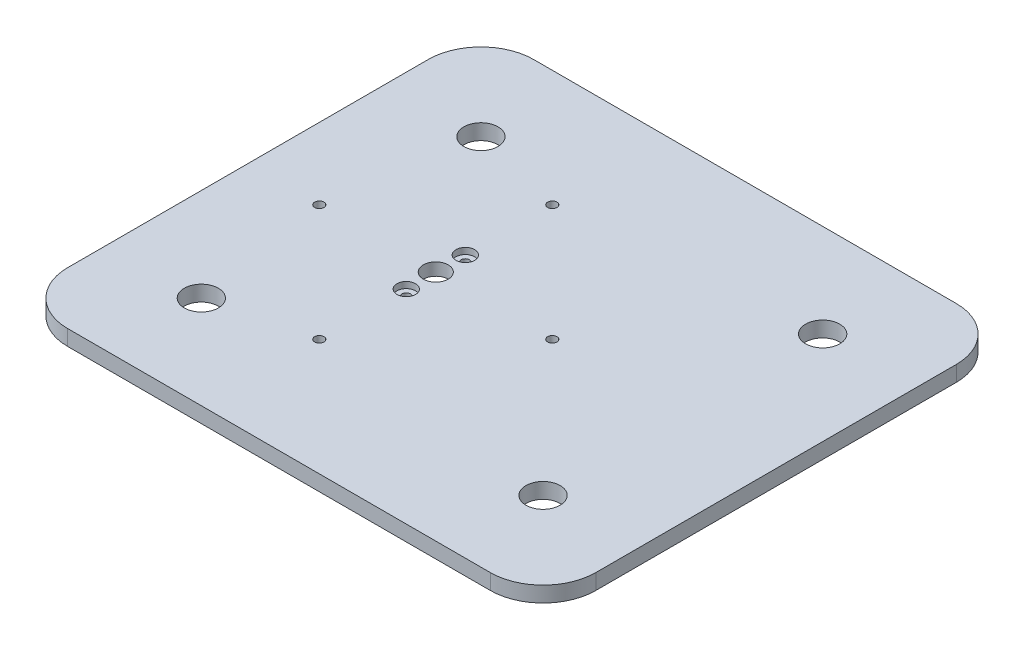
ISO-10303-21;
HEADER;
FILE_DESCRIPTION(('STEP AP214'),'2;1');
FILE_NAME('part.step','',(''),(''),'','','');
FILE_SCHEMA(('AUTOMOTIVE_DESIGN { 1 0 10303 214 1 1 1 1 }'));
ENDSEC;
DATA;
#1=APPLICATION_CONTEXT('core data for automotive mechanical design processes');
#2=APPLICATION_PROTOCOL_DEFINITION('international standard','automotive_design',2000,#1);
#3=PRODUCT_CONTEXT('',#1,'mechanical');
#4=PRODUCT('Part','Part','',(#3));
#5=PRODUCT_RELATED_PRODUCT_CATEGORY('part','',(#4));
#6=PRODUCT_DEFINITION_FORMATION('','',#4);
#7=PRODUCT_DEFINITION_CONTEXT('part definition',#1,'design');
#8=PRODUCT_DEFINITION('design','',#6,#7);
#9=PRODUCT_DEFINITION_SHAPE('','',#8);
#10=(LENGTH_UNIT() NAMED_UNIT(*) SI_UNIT(.MILLI.,.METRE.));
#11=(NAMED_UNIT(*) PLANE_ANGLE_UNIT() SI_UNIT($,.RADIAN.));
#12=(NAMED_UNIT(*) SI_UNIT($,.STERADIAN.) SOLID_ANGLE_UNIT());
#13=UNCERTAINTY_MEASURE_WITH_UNIT(LENGTH_MEASURE(1.E-05),#10,'distance_accuracy_value','');
#14=(GEOMETRIC_REPRESENTATION_CONTEXT(3) GLOBAL_UNCERTAINTY_ASSIGNED_CONTEXT((#13)) GLOBAL_UNIT_ASSIGNED_CONTEXT((#10,
#11,#12)) REPRESENTATION_CONTEXT('',''));
#15=CARTESIAN_POINT('',(0.,0.,0.));
#16=DIRECTION('',(0.,0.,1.));
#17=DIRECTION('',(1.,0.,0.));
#18=AXIS2_PLACEMENT_3D('',#15,#16,#17);
#19=CARTESIAN_POINT('',(236.203309246,-315.2128970931,-9.5));
#20=DIRECTION('',(0.,1.,0.));
#21=DIRECTION('',(0.,0.,1.));
#22=AXIS2_PLACEMENT_3D('',#19,#20,#21);
#23=CYLINDRICAL_SURFACE('',#22,1.34999999999998);
#24=CARTESIAN_POINT('',(236.203309246,-307.2128970931,-9.5));
#25=DIRECTION('',(0.,1.,0.));
#26=DIRECTION('',(0.,0.,1.));
#27=AXIS2_PLACEMENT_3D('',#24,#25,#26);
#28=CIRCLE('',#27,1.34999999999998);
#29=CARTESIAN_POINT('',(236.203309246,-307.2128970931,-8.15000000000002));
#30=VERTEX_POINT('',#29);
#31=EDGE_CURVE('E214',#30,#30,#28,.F.);
#32=ORIENTED_EDGE('',*,*,#31,.F.);
#33=EDGE_LOOP('',(#32));
#34=FACE_BOUND('',#33,.T.);
#35=CARTESIAN_POINT('',(236.203309246,-309.2128970931,-9.5));
#36=DIRECTION('',(0.,1.,0.));
#37=DIRECTION('',(0.,0.,1.));
#38=AXIS2_PLACEMENT_3D('',#35,#36,#37);
#39=CIRCLE('',#38,1.34999999999998);
#40=CARTESIAN_POINT('',(236.203309246,-309.2128970931,-8.15000000000002));
#41=VERTEX_POINT('',#40);
#42=EDGE_CURVE('E212',#41,#41,#39,.T.);
#43=ORIENTED_EDGE('',*,*,#42,.F.);
#44=EDGE_LOOP('',(#43));
#45=FACE_BOUND('',#44,.T.);
#46=ADVANCED_FACE('F17',(#34,#45),#23,.F.);
#47=CARTESIAN_POINT('',(236.203309246,-315.2128970931,9.5));
#48=DIRECTION('',(0.,1.,0.));
#49=DIRECTION('',(0.,0.,1.));
#50=AXIS2_PLACEMENT_3D('',#47,#48,#49);
#51=CYLINDRICAL_SURFACE('',#50,1.34999999999998);
#52=CARTESIAN_POINT('',(236.203309246,-307.2128970931,9.5));
#53=DIRECTION('',(0.,1.,0.));
#54=DIRECTION('',(0.,0.,1.));
#55=AXIS2_PLACEMENT_3D('',#52,#53,#54);
#56=CIRCLE('',#55,1.34999999999998);
#57=CARTESIAN_POINT('',(236.203309246,-307.2128970931,10.85));
#58=VERTEX_POINT('',#57);
#59=EDGE_CURVE('E20',#58,#58,#56,.F.);
#60=ORIENTED_EDGE('',*,*,#59,.F.);
#61=EDGE_LOOP('',(#60));
#62=FACE_BOUND('',#61,.T.);
#63=CARTESIAN_POINT('',(236.203309246,-309.2128970931,9.5));
#64=DIRECTION('',(0.,1.,0.));
#65=DIRECTION('',(0.,0.,1.));
#66=AXIS2_PLACEMENT_3D('',#63,#64,#65);
#67=CIRCLE('',#66,1.34999999999998);
#68=CARTESIAN_POINT('',(236.203309246,-309.2128970931,10.85));
#69=VERTEX_POINT('',#68);
#70=EDGE_CURVE('E206',#69,#69,#67,.T.);
#71=ORIENTED_EDGE('',*,*,#70,.F.);
#72=EDGE_LOOP('',(#71));
#73=FACE_BOUND('',#72,.T.);
#74=ADVANCED_FACE('F224',(#62,#73),#51,.F.);
#75=CARTESIAN_POINT('',(236.203309246,-309.2128970931,0.));
#76=DIRECTION('',(0.,-1.,0.));
#77=DIRECTION('',(0.,0.,-1.));
#78=AXIS2_PLACEMENT_3D('',#75,#76,#77);
#79=CYLINDRICAL_SURFACE('',#78,42.5);
#80=CARTESIAN_POINT('',(236.203309246,-309.2128970931,0.));
#81=DIRECTION('',(0.,-1.,0.));
#82=DIRECTION('',(0.,0.,-1.));
#83=AXIS2_PLACEMENT_3D('',#80,#81,#82);
#84=CIRCLE('',#83,42.5);
#85=CARTESIAN_POINT('',(236.203309246,-309.2128970931,-42.5));
#86=VERTEX_POINT('',#85);
#87=EDGE_CURVE('E209',#86,#86,#84,.T.);
#88=ORIENTED_EDGE('',*,*,#87,.F.);
#89=EDGE_LOOP('',(#88));
#90=FACE_BOUND('',#89,.T.);
#91=CARTESIAN_POINT('',(236.203309246,-310.2128970931,0.));
#92=DIRECTION('',(0.,-1.,0.));
#93=DIRECTION('',(0.,0.,-1.));
#94=AXIS2_PLACEMENT_3D('',#91,#92,#93);
#95=CIRCLE('',#94,42.5);
#96=CARTESIAN_POINT('',(236.203309246,-310.2128970931,-42.5));
#97=VERTEX_POINT('',#96);
#98=EDGE_CURVE('E203',#97,#97,#95,.T.);
#99=ORIENTED_EDGE('',*,*,#98,.T.);
#100=EDGE_LOOP('',(#99));
#101=FACE_BOUND('',#100,.T.);
#102=ADVANCED_FACE('F227',(#90,#101),#79,.F.);
#103=CARTESIAN_POINT('',(236.203309246,-307.2128970931,9.5));
#104=DIRECTION('',(0.,1.,0.));
#105=DIRECTION('',(0.,0.,1.));
#106=AXIS2_PLACEMENT_3D('',#103,#104,#105);
#107=PLANE('',#106);
#108=ORIENTED_EDGE('',*,*,#59,.T.);
#109=EDGE_LOOP('',(#108));
#110=FACE_BOUND('',#109,.T.);
#111=CARTESIAN_POINT('',(236.203309246,-307.2128970931,9.5));
#112=DIRECTION('',(0.,1.,0.));
#113=DIRECTION('',(0.,0.,1.));
#114=AXIS2_PLACEMENT_3D('',#111,#112,#113);
#115=CIRCLE('',#114,2.99999999999999);
#116=CARTESIAN_POINT('',(236.203309246,-307.2128970931,12.5));
#117=VERTEX_POINT('',#116);
#118=EDGE_CURVE('E188',#117,#117,#115,.T.);
#119=ORIENTED_EDGE('',*,*,#118,.T.);
#120=EDGE_LOOP('',(#119));
#121=FACE_BOUND('',#120,.T.);
#122=ADVANCED_FACE('F221',(#110,#121),#107,.T.);
#123=CARTESIAN_POINT('',(236.203309246,-307.2128970931,-9.5));
#124=DIRECTION('',(0.,1.,0.));
#125=DIRECTION('',(0.,0.,1.));
#126=AXIS2_PLACEMENT_3D('',#123,#124,#125);
#127=PLANE('',#126);
#128=ORIENTED_EDGE('',*,*,#31,.T.);
#129=EDGE_LOOP('',(#128));
#130=FACE_BOUND('',#129,.T.);
#131=CARTESIAN_POINT('',(236.203309246,-307.2128970931,-9.5));
#132=DIRECTION('',(0.,1.,0.));
#133=DIRECTION('',(0.,0.,1.));
#134=AXIS2_PLACEMENT_3D('',#131,#132,#133);
#135=CIRCLE('',#134,2.99999999999999);
#136=CARTESIAN_POINT('',(236.203309246,-307.2128970931,-6.50000000000001));
#137=VERTEX_POINT('',#136);
#138=EDGE_CURVE('E185',#137,#137,#135,.T.);
#139=ORIENTED_EDGE('',*,*,#138,.T.);
#140=EDGE_LOOP('',(#139));
#141=FACE_BOUND('',#140,.T.);
#142=ADVANCED_FACE('F233',(#130,#141),#127,.T.);
#143=CARTESIAN_POINT('',(236.203309246,-309.2128970931,0.));
#144=DIRECTION('',(0.,-1.,0.));
#145=DIRECTION('',(0.,0.,-1.));
#146=AXIS2_PLACEMENT_3D('',#143,#144,#145);
#147=PLANE('',#146);
#148=ORIENTED_EDGE('',*,*,#70,.T.);
#149=EDGE_LOOP('',(#148));
#150=FACE_BOUND('',#149,.T.);
#151=CARTESIAN_POINT('',(236.203309246,-309.2128970931,0.));
#152=DIRECTION('',(0.,-1.,0.));
#153=DIRECTION('',(0.,0.,-1.));
#154=AXIS2_PLACEMENT_3D('',#151,#152,#153);
#155=CIRCLE('',#154,3.99999999999999);
#156=CARTESIAN_POINT('',(236.203309246,-309.2128970931,-3.99999999999999));
#157=VERTEX_POINT('',#156);
#158=EDGE_CURVE('E103',#157,#157,#155,.F.);
#159=ORIENTED_EDGE('',*,*,#158,.T.);
#160=EDGE_LOOP('',(#159));
#161=FACE_BOUND('',#160,.T.);
#162=CARTESIAN_POINT('',(236.203309246,-309.2128970931,-37.5));
#163=DIRECTION('',(0.,1.,0.));
#164=DIRECTION('',(0.,0.,1.));
#165=AXIS2_PLACEMENT_3D('',#162,#163,#164);
#166=CIRCLE('',#165,1.49999999999999);
#167=CARTESIAN_POINT('',(236.203309246,-309.2128970931,-36.));
#168=VERTEX_POINT('',#167);
#169=EDGE_CURVE('E176',#168,#168,#166,.T.);
#170=ORIENTED_EDGE('',*,*,#169,.T.);
#171=EDGE_LOOP('',(#170));
#172=FACE_BOUND('',#171,.T.);
#173=CARTESIAN_POINT('',(236.203309246,-309.2128970931,37.5));
#174=DIRECTION('',(0.,1.,0.));
#175=DIRECTION('',(0.,0.,1.));
#176=AXIS2_PLACEMENT_3D('',#173,#174,#175);
#177=CIRCLE('',#176,1.49999999999999);
#178=CARTESIAN_POINT('',(236.203309246,-309.2128970931,39.));
#179=VERTEX_POINT('',#178);
#180=EDGE_CURVE('E182',#179,#179,#177,.T.);
#181=ORIENTED_EDGE('',*,*,#180,.T.);
#182=EDGE_LOOP('',(#181));
#183=FACE_BOUND('',#182,.T.);
#184=ORIENTED_EDGE('',*,*,#87,.T.);
#185=EDGE_LOOP('',(#184));
#186=FACE_BOUND('',#185,.T.);
#187=CARTESIAN_POINT('',(273.703309246,-309.2128970931,0.));
#188=DIRECTION('',(0.,1.,0.));
#189=DIRECTION('',(0.,0.,1.));
#190=AXIS2_PLACEMENT_3D('',#187,#188,#189);
#191=CIRCLE('',#190,1.50000000000002);
#192=CARTESIAN_POINT('',(273.703309246,-309.2128970931,1.50000000000002));
#193=VERTEX_POINT('',#192);
#194=EDGE_CURVE('E179',#193,#193,#191,.T.);
#195=ORIENTED_EDGE('',*,*,#194,.T.);
#196=EDGE_LOOP('',(#195));
#197=FACE_BOUND('',#196,.T.);
#198=CARTESIAN_POINT('',(198.703309246,-309.2128970931,0.));
#199=DIRECTION('',(0.,1.,0.));
#200=DIRECTION('',(0.,0.,1.));
#201=AXIS2_PLACEMENT_3D('',#198,#199,#200);
#202=CIRCLE('',#201,1.5);
#203=CARTESIAN_POINT('',(198.703309246,-309.2128970931,1.5));
#204=VERTEX_POINT('',#203);
#205=EDGE_CURVE('E173',#204,#204,#202,.T.);
#206=ORIENTED_EDGE('',*,*,#205,.T.);
#207=EDGE_LOOP('',(#206));
#208=FACE_BOUND('',#207,.T.);
#209=ORIENTED_EDGE('',*,*,#42,.T.);
#210=EDGE_LOOP('',(#209));
#211=FACE_BOUND('',#210,.T.);
#212=ADVANCED_FACE('F230',(#150,#161,#172,#183,#186,#197,#208,#211),#147,.T.);
#213=CARTESIAN_POINT('',(345.7354284339,-310.2128970931,0.));
#214=DIRECTION('',(0.,1.,0.));
#215=DIRECTION('',(0.,0.,1.));
#216=AXIS2_PLACEMENT_3D('',#213,#214,#215);
#217=PLANE('',#216);
#218=CARTESIAN_POINT('',(192.7354284339,-310.2128970931,-58.));
#219=DIRECTION('',(0.,1.,0.));
#220=DIRECTION('',(0.,0.,1.));
#221=AXIS2_PLACEMENT_3D('',#218,#219,#220);
#222=CIRCLE('',#221,17.);
#223=CARTESIAN_POINT('',(192.7354284339,-310.2128970931,-75.));
#224=VERTEX_POINT('',#223);
#225=CARTESIAN_POINT('',(175.7354284339,-310.2128970931,-58.));
#226=VERTEX_POINT('',#225);
#227=EDGE_CURVE('E169',#224,#226,#222,.T.);
#228=ORIENTED_EDGE('',*,*,#227,.F.);
#229=DIRECTION('',(1.,0.,0.));
#230=VECTOR('',#229,1.);
#231=CARTESIAN_POINT('',(0.,-310.2128970931,-75.));
#232=LINE('',#231,#230);
#233=CARTESIAN_POINT('',(328.7354284339,-310.2128970931,-75.));
#234=VERTEX_POINT('',#233);
#235=EDGE_CURVE('E117',#224,#234,#232,.T.);
#236=ORIENTED_EDGE('',*,*,#235,.T.);
#237=CARTESIAN_POINT('',(328.7354284339,-310.2128970931,-58.));
#238=DIRECTION('',(0.,-1.,0.));
#239=DIRECTION('',(0.,0.,-1.));
#240=AXIS2_PLACEMENT_3D('',#237,#238,#239);
#241=CIRCLE('',#240,17.);
#242=CARTESIAN_POINT('',(345.7354284339,-310.2128970931,-58.));
#243=VERTEX_POINT('',#242);
#244=EDGE_CURVE('E167',#243,#234,#241,.F.);
#245=ORIENTED_EDGE('',*,*,#244,.F.);
#246=DIRECTION('',(0.,0.,-1.));
#247=VECTOR('',#246,1.);
#248=CARTESIAN_POINT('',(345.7354284339,-310.2128970931,0.));
#249=LINE('',#248,#247);
#250=CARTESIAN_POINT('',(345.7354284339,-310.2128970931,58.));
#251=VERTEX_POINT('',#250);
#252=EDGE_CURVE('E113',#251,#243,#249,.T.);
#253=ORIENTED_EDGE('',*,*,#252,.F.);
#254=CARTESIAN_POINT('',(328.7354284339,-310.2128970931,58.));
#255=DIRECTION('',(0.,1.,0.));
#256=DIRECTION('',(0.,0.,1.));
#257=AXIS2_PLACEMENT_3D('',#254,#255,#256);
#258=CIRCLE('',#257,17.);
#259=CARTESIAN_POINT('',(328.7354284339,-310.2128970931,75.));
#260=VERTEX_POINT('',#259);
#261=EDGE_CURVE('E99',#260,#251,#258,.T.);
#262=ORIENTED_EDGE('',*,*,#261,.F.);
#263=DIRECTION('',(1.,0.,0.));
#264=VECTOR('',#263,1.);
#265=CARTESIAN_POINT('',(0.,-310.2128970931,75.));
#266=LINE('',#265,#264);
#267=CARTESIAN_POINT('',(192.7354284339,-310.2128970931,75.));
#268=VERTEX_POINT('',#267);
#269=EDGE_CURVE('E92',#268,#260,#266,.T.);
#270=ORIENTED_EDGE('',*,*,#269,.F.);
#271=CARTESIAN_POINT('',(192.7354284339,-310.2128970931,58.));
#272=DIRECTION('',(0.,-1.,0.));
#273=DIRECTION('',(0.,0.,-1.));
#274=AXIS2_PLACEMENT_3D('',#271,#272,#273);
#275=CIRCLE('',#274,17.);
#276=CARTESIAN_POINT('',(175.7354284339,-310.2128970931,58.));
#277=VERTEX_POINT('',#276);
#278=EDGE_CURVE('E83',#277,#268,#275,.F.);
#279=ORIENTED_EDGE('',*,*,#278,.F.);
#280=DIRECTION('',(0.,0.,1.));
#281=VECTOR('',#280,1.);
#282=CARTESIAN_POINT('',(175.7354284339,-310.2128970931,0.));
#283=LINE('',#282,#281);
#284=EDGE_CURVE('E78',#226,#277,#283,.T.);
#285=ORIENTED_EDGE('',*,*,#284,.F.);
#286=EDGE_LOOP('',(#228,#236,#245,#253,#262,#270,#279,#285));
#287=FACE_BOUND('',#286,.T.);
#288=ORIENTED_EDGE('',*,*,#98,.F.);
#289=EDGE_LOOP('',(#288));
#290=FACE_BOUND('',#289,.T.);
#291=CARTESIAN_POINT('',(205.7354284339,-310.2128970931,-45.));
#292=DIRECTION('',(0.,-1.,0.));
#293=DIRECTION('',(0.,0.,-1.));
#294=AXIS2_PLACEMENT_3D('',#291,#292,#293);
#295=CIRCLE('',#294,5.50000000000002);
#296=CARTESIAN_POINT('',(205.7354284339,-310.2128970931,-50.5));
#297=VERTEX_POINT('',#296);
#298=EDGE_CURVE('E191',#297,#297,#295,.F.);
#299=ORIENTED_EDGE('',*,*,#298,.T.);
#300=EDGE_LOOP('',(#299));
#301=FACE_BOUND('',#300,.T.);
#302=CARTESIAN_POINT('',(205.7354284339,-310.2128970931,45.));
#303=DIRECTION('',(0.,-1.,0.));
#304=DIRECTION('',(0.,0.,-1.));
#305=AXIS2_PLACEMENT_3D('',#302,#303,#304);
#306=CIRCLE('',#305,5.50000000000002);
#307=CARTESIAN_POINT('',(205.7354284339,-310.2128970931,39.5));
#308=VERTEX_POINT('',#307);
#309=EDGE_CURVE('E194',#308,#308,#306,.F.);
#310=ORIENTED_EDGE('',*,*,#309,.T.);
#311=EDGE_LOOP('',(#310));
#312=FACE_BOUND('',#311,.T.);
#313=CARTESIAN_POINT('',(315.7354284339,-310.2128970931,-45.));
#314=DIRECTION('',(0.,-1.,0.));
#315=DIRECTION('',(0.,0.,-1.));
#316=AXIS2_PLACEMENT_3D('',#313,#314,#315);
#317=CIRCLE('',#316,5.50000000000002);
#318=CARTESIAN_POINT('',(315.7354284339,-310.2128970931,-50.5));
#319=VERTEX_POINT('',#318);
#320=EDGE_CURVE('E197',#319,#319,#317,.F.);
#321=ORIENTED_EDGE('',*,*,#320,.T.);
#322=EDGE_LOOP('',(#321));
#323=FACE_BOUND('',#322,.T.);
#324=CARTESIAN_POINT('',(315.7354284339,-310.2128970931,45.));
#325=DIRECTION('',(0.,-1.,0.));
#326=DIRECTION('',(0.,0.,-1.));
#327=AXIS2_PLACEMENT_3D('',#324,#325,#326);
#328=CIRCLE('',#327,5.50000000000002);
#329=CARTESIAN_POINT('',(315.7354284339,-310.2128970931,39.5));
#330=VERTEX_POINT('',#329);
#331=EDGE_CURVE('E200',#330,#330,#328,.F.);
#332=ORIENTED_EDGE('',*,*,#331,.T.);
#333=EDGE_LOOP('',(#332));
#334=FACE_BOUND('',#333,.T.);
#335=ADVANCED_FACE('F96',(#287,#290,#301,#312,#323,#334),#217,.F.);
#336=CARTESIAN_POINT('',(315.7354284339,-300.2128970931,45.));
#337=DIRECTION('',(0.,-1.,0.));
#338=DIRECTION('',(0.,0.,-1.));
#339=AXIS2_PLACEMENT_3D('',#336,#337,#338);
#340=CYLINDRICAL_SURFACE('',#339,5.50000000000002);
#341=CARTESIAN_POINT('',(315.7354284339,-305.2128970931,45.));
#342=DIRECTION('',(0.,-1.,0.));
#343=DIRECTION('',(0.,0.,-1.));
#344=AXIS2_PLACEMENT_3D('',#341,#342,#343);
#345=CIRCLE('',#344,5.50000000000002);
#346=CARTESIAN_POINT('',(315.7354284339,-305.2128970931,39.5));
#347=VERTEX_POINT('',#346);
#348=EDGE_CURVE('E162',#347,#347,#345,.F.);
#349=ORIENTED_EDGE('',*,*,#348,.T.);
#350=EDGE_LOOP('',(#349));
#351=FACE_BOUND('',#350,.T.);
#352=ORIENTED_EDGE('',*,*,#331,.F.);
#353=EDGE_LOOP('',(#352));
#354=FACE_BOUND('',#353,.T.);
#355=ADVANCED_FACE('F328',(#351,#354),#340,.F.);
#356=CARTESIAN_POINT('',(315.7354284339,-300.2128970931,-45.));
#357=DIRECTION('',(0.,-1.,0.));
#358=DIRECTION('',(0.,0.,-1.));
#359=AXIS2_PLACEMENT_3D('',#356,#357,#358);
#360=CYLINDRICAL_SURFACE('',#359,5.50000000000002);
#361=CARTESIAN_POINT('',(315.7354284339,-305.2128970931,-45.));
#362=DIRECTION('',(0.,-1.,0.));
#363=DIRECTION('',(0.,0.,-1.));
#364=AXIS2_PLACEMENT_3D('',#361,#362,#363);
#365=CIRCLE('',#364,5.50000000000002);
#366=CARTESIAN_POINT('',(315.7354284339,-305.2128970931,-50.5));
#367=VERTEX_POINT('',#366);
#368=EDGE_CURVE('E159',#367,#367,#365,.F.);
#369=ORIENTED_EDGE('',*,*,#368,.T.);
#370=EDGE_LOOP('',(#369));
#371=FACE_BOUND('',#370,.T.);
#372=ORIENTED_EDGE('',*,*,#320,.F.);
#373=EDGE_LOOP('',(#372));
#374=FACE_BOUND('',#373,.T.);
#375=ADVANCED_FACE('F324',(#371,#374),#360,.F.);
#376=CARTESIAN_POINT('',(205.7354284339,-300.2128970931,45.));
#377=DIRECTION('',(0.,-1.,0.));
#378=DIRECTION('',(0.,0.,-1.));
#379=AXIS2_PLACEMENT_3D('',#376,#377,#378);
#380=CYLINDRICAL_SURFACE('',#379,5.50000000000002);
#381=CARTESIAN_POINT('',(205.7354284339,-305.2128970931,45.));
#382=DIRECTION('',(0.,-1.,0.));
#383=DIRECTION('',(0.,0.,-1.));
#384=AXIS2_PLACEMENT_3D('',#381,#382,#383);
#385=CIRCLE('',#384,5.50000000000002);
#386=CARTESIAN_POINT('',(205.7354284339,-305.2128970931,39.5));
#387=VERTEX_POINT('',#386);
#388=EDGE_CURVE('E156',#387,#387,#385,.F.);
#389=ORIENTED_EDGE('',*,*,#388,.T.);
#390=EDGE_LOOP('',(#389));
#391=FACE_BOUND('',#390,.T.);
#392=ORIENTED_EDGE('',*,*,#309,.F.);
#393=EDGE_LOOP('',(#392));
#394=FACE_BOUND('',#393,.T.);
#395=ADVANCED_FACE('F320',(#391,#394),#380,.F.);
#396=CARTESIAN_POINT('',(205.7354284339,-300.2128970931,-45.));
#397=DIRECTION('',(0.,-1.,0.));
#398=DIRECTION('',(0.,0.,-1.));
#399=AXIS2_PLACEMENT_3D('',#396,#397,#398);
#400=CYLINDRICAL_SURFACE('',#399,5.50000000000002);
#401=CARTESIAN_POINT('',(205.7354284339,-305.2128970931,-45.));
#402=DIRECTION('',(0.,-1.,0.));
#403=DIRECTION('',(0.,0.,-1.));
#404=AXIS2_PLACEMENT_3D('',#401,#402,#403);
#405=CIRCLE('',#404,5.50000000000002);
#406=CARTESIAN_POINT('',(205.7354284339,-305.2128970931,-50.5));
#407=VERTEX_POINT('',#406);
#408=EDGE_CURVE('E153',#407,#407,#405,.F.);
#409=ORIENTED_EDGE('',*,*,#408,.T.);
#410=EDGE_LOOP('',(#409));
#411=FACE_BOUND('',#410,.T.);
#412=ORIENTED_EDGE('',*,*,#298,.F.);
#413=EDGE_LOOP('',(#412));
#414=FACE_BOUND('',#413,.T.);
#415=ADVANCED_FACE('F316',(#411,#414),#400,.F.);
#416=CARTESIAN_POINT('',(236.203309246,-307.2128970931,9.5));
#417=DIRECTION('',(0.,1.,0.));
#418=DIRECTION('',(0.,0.,1.));
#419=AXIS2_PLACEMENT_3D('',#416,#417,#418);
#420=CYLINDRICAL_SURFACE('',#419,2.99999999999999);
#421=ORIENTED_EDGE('',*,*,#118,.F.);
#422=EDGE_LOOP('',(#421));
#423=FACE_BOUND('',#422,.T.);
#424=CARTESIAN_POINT('',(236.203309246,-305.2128970931,9.5));
#425=DIRECTION('',(0.,1.,0.));
#426=DIRECTION('',(0.,0.,1.));
#427=AXIS2_PLACEMENT_3D('',#424,#425,#426);
#428=CIRCLE('',#427,2.99999999999999);
#429=CARTESIAN_POINT('',(236.203309246,-305.2128970931,12.5));
#430=VERTEX_POINT('',#429);
#431=EDGE_CURVE('E150',#430,#430,#428,.T.);
#432=ORIENTED_EDGE('',*,*,#431,.T.);
#433=EDGE_LOOP('',(#432));
#434=FACE_BOUND('',#433,.T.);
#435=ADVANCED_FACE('F312',(#423,#434),#420,.F.);
#436=CARTESIAN_POINT('',(236.203309246,-307.2128970931,-9.5));
#437=DIRECTION('',(0.,1.,0.));
#438=DIRECTION('',(0.,0.,1.));
#439=AXIS2_PLACEMENT_3D('',#436,#437,#438);
#440=CYLINDRICAL_SURFACE('',#439,2.99999999999999);
#441=ORIENTED_EDGE('',*,*,#138,.F.);
#442=EDGE_LOOP('',(#441));
#443=FACE_BOUND('',#442,.T.);
#444=CARTESIAN_POINT('',(236.203309246,-305.2128970931,-9.5));
#445=DIRECTION('',(0.,1.,0.));
#446=DIRECTION('',(0.,0.,1.));
#447=AXIS2_PLACEMENT_3D('',#444,#445,#446);
#448=CIRCLE('',#447,2.99999999999999);
#449=CARTESIAN_POINT('',(236.203309246,-305.2128970931,-6.50000000000001));
#450=VERTEX_POINT('',#449);
#451=EDGE_CURVE('E147',#450,#450,#448,.T.);
#452=ORIENTED_EDGE('',*,*,#451,.T.);
#453=EDGE_LOOP('',(#452));
#454=FACE_BOUND('',#453,.T.);
#455=ADVANCED_FACE('F308',(#443,#454),#440,.F.);
#456=CARTESIAN_POINT('',(236.203309246,-315.2128970931,37.5));
#457=DIRECTION('',(0.,1.,0.));
#458=DIRECTION('',(0.,0.,1.));
#459=AXIS2_PLACEMENT_3D('',#456,#457,#458);
#460=CYLINDRICAL_SURFACE('',#459,1.49999999999999);
#461=ORIENTED_EDGE('',*,*,#180,.F.);
#462=EDGE_LOOP('',(#461));
#463=FACE_BOUND('',#462,.T.);
#464=CARTESIAN_POINT('',(236.203309246,-305.2128970931,37.5));
#465=DIRECTION('',(0.,1.,0.));
#466=DIRECTION('',(0.,0.,1.));
#467=AXIS2_PLACEMENT_3D('',#464,#465,#466);
#468=CIRCLE('',#467,1.49999999999999);
#469=CARTESIAN_POINT('',(236.203309246,-305.2128970931,39.));
#470=VERTEX_POINT('',#469);
#471=EDGE_CURVE('E144',#470,#470,#468,.T.);
#472=ORIENTED_EDGE('',*,*,#471,.T.);
#473=EDGE_LOOP('',(#472));
#474=FACE_BOUND('',#473,.T.);
#475=ADVANCED_FACE('F304',(#463,#474),#460,.F.);
#476=CARTESIAN_POINT('',(273.703309246,-315.2128970931,0.));
#477=DIRECTION('',(0.,1.,0.));
#478=DIRECTION('',(0.,0.,1.));
#479=AXIS2_PLACEMENT_3D('',#476,#477,#478);
#480=CYLINDRICAL_SURFACE('',#479,1.50000000000002);
#481=ORIENTED_EDGE('',*,*,#194,.F.);
#482=EDGE_LOOP('',(#481));
#483=FACE_BOUND('',#482,.T.);
#484=CARTESIAN_POINT('',(273.703309246,-305.2128970931,0.));
#485=DIRECTION('',(0.,1.,0.));
#486=DIRECTION('',(0.,0.,1.));
#487=AXIS2_PLACEMENT_3D('',#484,#485,#486);
#488=CIRCLE('',#487,1.50000000000002);
#489=CARTESIAN_POINT('',(273.703309246,-305.2128970931,1.50000000000002));
#490=VERTEX_POINT('',#489);
#491=EDGE_CURVE('E141',#490,#490,#488,.T.);
#492=ORIENTED_EDGE('',*,*,#491,.T.);
#493=EDGE_LOOP('',(#492));
#494=FACE_BOUND('',#493,.T.);
#495=ADVANCED_FACE('F300',(#483,#494),#480,.F.);
#496=CARTESIAN_POINT('',(236.203309246,-315.2128970931,-37.5));
#497=DIRECTION('',(0.,1.,0.));
#498=DIRECTION('',(0.,0.,1.));
#499=AXIS2_PLACEMENT_3D('',#496,#497,#498);
#500=CYLINDRICAL_SURFACE('',#499,1.49999999999999);
#501=ORIENTED_EDGE('',*,*,#169,.F.);
#502=EDGE_LOOP('',(#501));
#503=FACE_BOUND('',#502,.T.);
#504=CARTESIAN_POINT('',(236.203309246,-305.2128970931,-37.5));
#505=DIRECTION('',(0.,1.,0.));
#506=DIRECTION('',(0.,0.,1.));
#507=AXIS2_PLACEMENT_3D('',#504,#505,#506);
#508=CIRCLE('',#507,1.49999999999999);
#509=CARTESIAN_POINT('',(236.203309246,-305.2128970931,-36.));
#510=VERTEX_POINT('',#509);
#511=EDGE_CURVE('E138',#510,#510,#508,.T.);
#512=ORIENTED_EDGE('',*,*,#511,.T.);
#513=EDGE_LOOP('',(#512));
#514=FACE_BOUND('',#513,.T.);
#515=ADVANCED_FACE('F296',(#503,#514),#500,.F.);
#516=CARTESIAN_POINT('',(198.703309246,-315.2128970931,0.));
#517=DIRECTION('',(0.,1.,0.));
#518=DIRECTION('',(0.,0.,1.));
#519=AXIS2_PLACEMENT_3D('',#516,#517,#518);
#520=CYLINDRICAL_SURFACE('',#519,1.5);
#521=ORIENTED_EDGE('',*,*,#205,.F.);
#522=EDGE_LOOP('',(#521));
#523=FACE_BOUND('',#522,.T.);
#524=CARTESIAN_POINT('',(198.703309246,-305.2128970931,0.));
#525=DIRECTION('',(0.,1.,0.));
#526=DIRECTION('',(0.,0.,1.));
#527=AXIS2_PLACEMENT_3D('',#524,#525,#526);
#528=CIRCLE('',#527,1.5);
#529=CARTESIAN_POINT('',(198.703309246,-305.2128970931,1.5));
#530=VERTEX_POINT('',#529);
#531=EDGE_CURVE('E135',#530,#530,#528,.T.);
#532=ORIENTED_EDGE('',*,*,#531,.T.);
#533=EDGE_LOOP('',(#532));
#534=FACE_BOUND('',#533,.T.);
#535=ADVANCED_FACE('F292',(#523,#534),#520,.F.);
#536=CARTESIAN_POINT('',(236.203309246,-300.2128970931,0.));
#537=DIRECTION('',(0.,-1.,0.));
#538=DIRECTION('',(0.,0.,-1.));
#539=AXIS2_PLACEMENT_3D('',#536,#537,#538);
#540=CYLINDRICAL_SURFACE('',#539,3.99999999999999);
#541=CARTESIAN_POINT('',(236.203309246,-305.2128970931,0.));
#542=DIRECTION('',(0.,-1.,0.));
#543=DIRECTION('',(0.,0.,-1.));
#544=AXIS2_PLACEMENT_3D('',#541,#542,#543);
#545=CIRCLE('',#544,3.99999999999999);
#546=CARTESIAN_POINT('',(236.203309246,-305.2128970931,-3.99999999999999));
#547=VERTEX_POINT('',#546);
#548=EDGE_CURVE('E132',#547,#547,#545,.F.);
#549=ORIENTED_EDGE('',*,*,#548,.T.);
#550=EDGE_LOOP('',(#549));
#551=FACE_BOUND('',#550,.T.);
#552=ORIENTED_EDGE('',*,*,#158,.F.);
#553=EDGE_LOOP('',(#552));
#554=FACE_BOUND('',#553,.T.);
#555=ADVANCED_FACE('F289',(#551,#554),#540,.F.);
#556=CARTESIAN_POINT('',(0.,0.,75.));
#557=DIRECTION('',(0.,0.,1.));
#558=DIRECTION('',(1.,0.,0.));
#559=AXIS2_PLACEMENT_3D('',#556,#557,#558);
#560=PLANE('',#559);
#561=ORIENTED_EDGE('',*,*,#269,.T.);
#562=DIRECTION('',(0.,1.,0.));
#563=VECTOR('',#562,1.);
#564=CARTESIAN_POINT('',(328.7354284339,-739.945452979,75.));
#565=LINE('',#564,#563);
#566=CARTESIAN_POINT('',(328.7354284339,-305.2128970931,75.));
#567=VERTEX_POINT('',#566);
#568=EDGE_CURVE('E166',#567,#260,#565,.F.);
#569=ORIENTED_EDGE('',*,*,#568,.F.);
#570=DIRECTION('',(1.,0.,0.));
#571=VECTOR('',#570,1.);
#572=CARTESIAN_POINT('',(175.7354284339,-305.2128970931,75.));
#573=LINE('',#572,#571);
#574=CARTESIAN_POINT('',(192.7354284339,-305.2128970931,75.));
#575=VERTEX_POINT('',#574);
#576=EDGE_CURVE('E107',#567,#575,#573,.F.);
#577=ORIENTED_EDGE('',*,*,#576,.T.);
#578=DIRECTION('',(0.,-1.,0.));
#579=VECTOR('',#578,1.);
#580=CARTESIAN_POINT('',(192.7354284339,418.7328062612,75.));
#581=LINE('',#580,#579);
#582=EDGE_CURVE('E88',#268,#575,#581,.F.);
#583=ORIENTED_EDGE('',*,*,#582,.F.);
#584=EDGE_LOOP('',(#561,#569,#577,#583));
#585=FACE_BOUND('',#584,.T.);
#586=ADVANCED_FACE('F106',(#585),#560,.T.);
#587=CARTESIAN_POINT('',(192.7354284339,418.7328062612,58.));
#588=DIRECTION('',(0.,-1.,0.));
#589=DIRECTION('',(0.,0.,-1.));
#590=AXIS2_PLACEMENT_3D('',#587,#588,#589);
#591=CYLINDRICAL_SURFACE('',#590,17.);
#592=ORIENTED_EDGE('',*,*,#278,.T.);
#593=ORIENTED_EDGE('',*,*,#582,.T.);
#594=CARTESIAN_POINT('',(192.7354284339,-305.2128970931,58.));
#595=DIRECTION('',(0.,-1.,0.));
#596=DIRECTION('',(0.,0.,-1.));
#597=AXIS2_PLACEMENT_3D('',#594,#595,#596);
#598=CIRCLE('',#597,17.);
#599=CARTESIAN_POINT('',(175.7354284339,-305.2128970931,58.));
#600=VERTEX_POINT('',#599);
#601=EDGE_CURVE('E130',#575,#600,#598,.T.);
#602=ORIENTED_EDGE('',*,*,#601,.T.);
#603=DIRECTION('',(0.,1.,0.));
#604=VECTOR('',#603,1.);
#605=CARTESIAN_POINT('',(175.7354284339,-304.2128970931,58.));
#606=LINE('',#605,#604);
#607=EDGE_CURVE('E90',#277,#600,#606,.T.);
#608=ORIENTED_EDGE('',*,*,#607,.F.);
#609=EDGE_LOOP('',(#592,#593,#602,#608));
#610=FACE_BOUND('',#609,.T.);
#611=ADVANCED_FACE('F85',(#610),#591,.T.);
#612=CARTESIAN_POINT('',(175.7354284339,-304.2128970931,0.));
#613=DIRECTION('',(-1.,0.,0.));
#614=DIRECTION('',(0.,0.,1.));
#615=AXIS2_PLACEMENT_3D('',#612,#613,#614);
#616=PLANE('',#615);
#617=ORIENTED_EDGE('',*,*,#284,.T.);
#618=ORIENTED_EDGE('',*,*,#607,.T.);
#619=DIRECTION('',(0.,0.,-1.));
#620=VECTOR('',#619,1.);
#621=CARTESIAN_POINT('',(175.7354284339,-305.2128970931,-75.));
#622=LINE('',#621,#620);
#623=CARTESIAN_POINT('',(175.7354284339,-305.2128970931,-58.));
#624=VERTEX_POINT('',#623);
#625=EDGE_CURVE('E129',#600,#624,#622,.T.);
#626=ORIENTED_EDGE('',*,*,#625,.T.);
#627=DIRECTION('',(0.,1.,0.));
#628=VECTOR('',#627,1.);
#629=CARTESIAN_POINT('',(175.7354284339,418.7328062612,-58.));
#630=LINE('',#629,#628);
#631=EDGE_CURVE('E120',#226,#624,#630,.T.);
#632=ORIENTED_EDGE('',*,*,#631,.F.);
#633=EDGE_LOOP('',(#617,#618,#626,#632));
#634=FACE_BOUND('',#633,.T.);
#635=ADVANCED_FACE('F281',(#634),#616,.T.);
#636=CARTESIAN_POINT('',(192.7354284339,418.7328062612,-58.));
#637=DIRECTION('',(0.,1.,0.));
#638=DIRECTION('',(0.,0.,1.));
#639=AXIS2_PLACEMENT_3D('',#636,#637,#638);
#640=CYLINDRICAL_SURFACE('',#639,17.);
#641=ORIENTED_EDGE('',*,*,#227,.T.);
#642=ORIENTED_EDGE('',*,*,#631,.T.);
#643=CARTESIAN_POINT('',(192.7354284339,-305.2128970931,-58.));
#644=DIRECTION('',(0.,1.,0.));
#645=DIRECTION('',(0.,0.,1.));
#646=AXIS2_PLACEMENT_3D('',#643,#644,#645);
#647=CIRCLE('',#646,17.);
#648=CARTESIAN_POINT('',(192.7354284339,-305.2128970931,-75.));
#649=VERTEX_POINT('',#648);
#650=EDGE_CURVE('E126',#624,#649,#647,.F.);
#651=ORIENTED_EDGE('',*,*,#650,.T.);
#652=DIRECTION('',(0.,1.,0.));
#653=VECTOR('',#652,1.);
#654=CARTESIAN_POINT('',(192.7354284339,0.,-75.));
#655=LINE('',#654,#653);
#656=EDGE_CURVE('E119',#649,#224,#655,.F.);
#657=ORIENTED_EDGE('',*,*,#656,.T.);
#658=EDGE_LOOP('',(#641,#642,#651,#657));
#659=FACE_BOUND('',#658,.T.);
#660=ADVANCED_FACE('F277',(#659),#640,.T.);
#661=CARTESIAN_POINT('',(0.,0.,-75.));
#662=DIRECTION('',(0.,0.,1.));
#663=DIRECTION('',(1.,0.,0.));
#664=AXIS2_PLACEMENT_3D('',#661,#662,#663);
#665=PLANE('',#664);
#666=DIRECTION('',(1.,0.,0.));
#667=VECTOR('',#666,1.);
#668=CARTESIAN_POINT('',(175.7354284339,-305.2128970931,-75.));
#669=LINE('',#668,#667);
#670=CARTESIAN_POINT('',(328.7354284339,-305.2128970931,-75.));
#671=VERTEX_POINT('',#670);
#672=EDGE_CURVE('E125',#649,#671,#669,.T.);
#673=ORIENTED_EDGE('',*,*,#672,.T.);
#674=DIRECTION('',(0.,-1.,0.));
#675=VECTOR('',#674,1.);
#676=CARTESIAN_POINT('',(328.7354284339,-739.945452979,-75.));
#677=LINE('',#676,#675);
#678=EDGE_CURVE('E115',#234,#671,#677,.F.);
#679=ORIENTED_EDGE('',*,*,#678,.F.);
#680=ORIENTED_EDGE('',*,*,#235,.F.);
#681=ORIENTED_EDGE('',*,*,#656,.F.);
#682=EDGE_LOOP('',(#673,#679,#680,#681));
#683=FACE_BOUND('',#682,.T.);
#684=ADVANCED_FACE('F273',(#683),#665,.F.);
#685=CARTESIAN_POINT('',(328.7354284339,-739.945452979,-58.));
#686=DIRECTION('',(0.,-1.,0.));
#687=DIRECTION('',(0.,0.,-1.));
#688=AXIS2_PLACEMENT_3D('',#685,#686,#687);
#689=CYLINDRICAL_SURFACE('',#688,17.);
#690=ORIENTED_EDGE('',*,*,#244,.T.);
#691=ORIENTED_EDGE('',*,*,#678,.T.);
#692=CARTESIAN_POINT('',(328.7354284339,-305.2128970931,-58.));
#693=DIRECTION('',(0.,-1.,0.));
#694=DIRECTION('',(0.,0.,-1.));
#695=AXIS2_PLACEMENT_3D('',#692,#693,#694);
#696=CIRCLE('',#695,17.);
#697=CARTESIAN_POINT('',(345.7354284339,-305.2128970931,-58.));
#698=VERTEX_POINT('',#697);
#699=EDGE_CURVE('E122',#671,#698,#696,.T.);
#700=ORIENTED_EDGE('',*,*,#699,.T.);
#701=DIRECTION('',(0.,1.,0.));
#702=VECTOR('',#701,1.);
#703=CARTESIAN_POINT('',(345.7354284339,-316.2128970931,-58.));
#704=LINE('',#703,#702);
#705=EDGE_CURVE('E114',#243,#698,#704,.T.);
#706=ORIENTED_EDGE('',*,*,#705,.F.);
#707=EDGE_LOOP('',(#690,#691,#700,#706));
#708=FACE_BOUND('',#707,.T.);
#709=ADVANCED_FACE('F269',(#708),#689,.T.);
#710=CARTESIAN_POINT('',(345.7354284339,-316.2128970931,0.));
#711=DIRECTION('',(1.,0.,0.));
#712=DIRECTION('',(0.,0.,-1.));
#713=AXIS2_PLACEMENT_3D('',#710,#711,#712);
#714=PLANE('',#713);
#715=ORIENTED_EDGE('',*,*,#252,.T.);
#716=ORIENTED_EDGE('',*,*,#705,.T.);
#717=DIRECTION('',(0.,0.,-1.));
#718=VECTOR('',#717,1.);
#719=CARTESIAN_POINT('',(345.7354284339,-305.2128970931,-75.));
#720=LINE('',#719,#718);
#721=CARTESIAN_POINT('',(345.7354284339,-305.2128970931,58.));
#722=VERTEX_POINT('',#721);
#723=EDGE_CURVE('E26',#698,#722,#720,.F.);
#724=ORIENTED_EDGE('',*,*,#723,.T.);
#725=DIRECTION('',(0.,1.,0.));
#726=VECTOR('',#725,1.);
#727=CARTESIAN_POINT('',(345.7354284339,-739.945452979,58.));
#728=LINE('',#727,#726);
#729=EDGE_CURVE('E34',#251,#722,#728,.T.);
#730=ORIENTED_EDGE('',*,*,#729,.F.);
#731=EDGE_LOOP('',(#715,#716,#724,#730));
#732=FACE_BOUND('',#731,.T.);
#733=ADVANCED_FACE('F262',(#732),#714,.T.);
#734=CARTESIAN_POINT('',(328.7354284339,-739.945452979,58.));
#735=DIRECTION('',(0.,1.,0.));
#736=DIRECTION('',(0.,0.,1.));
#737=AXIS2_PLACEMENT_3D('',#734,#735,#736);
#738=CYLINDRICAL_SURFACE('',#737,17.);
#739=ORIENTED_EDGE('',*,*,#261,.T.);
#740=ORIENTED_EDGE('',*,*,#729,.T.);
#741=CARTESIAN_POINT('',(328.7354284339,-305.2128970931,58.));
#742=DIRECTION('',(0.,1.,0.));
#743=DIRECTION('',(0.,0.,1.));
#744=AXIS2_PLACEMENT_3D('',#741,#742,#743);
#745=CIRCLE('',#744,17.);
#746=EDGE_CURVE('E11',#722,#567,#745,.F.);
#747=ORIENTED_EDGE('',*,*,#746,.T.);
#748=ORIENTED_EDGE('',*,*,#568,.T.);
#749=EDGE_LOOP('',(#739,#740,#747,#748));
#750=FACE_BOUND('',#749,.T.);
#751=ADVANCED_FACE('F256',(#750),#738,.T.);
#752=CARTESIAN_POINT('',(175.7354284339,-305.2128970931,-75.));
#753=DIRECTION('',(0.,-1.,0.));
#754=DIRECTION('',(0.,0.,-1.));
#755=AXIS2_PLACEMENT_3D('',#752,#753,#754);
#756=PLANE('',#755);
#757=ORIENTED_EDGE('',*,*,#723,.F.);
#758=ORIENTED_EDGE('',*,*,#699,.F.);
#759=ORIENTED_EDGE('',*,*,#672,.F.);
#760=ORIENTED_EDGE('',*,*,#650,.F.);
#761=ORIENTED_EDGE('',*,*,#625,.F.);
#762=ORIENTED_EDGE('',*,*,#601,.F.);
#763=ORIENTED_EDGE('',*,*,#576,.F.);
#764=ORIENTED_EDGE('',*,*,#746,.F.);
#765=EDGE_LOOP('',(#757,#758,#759,#760,#761,#762,#763,#764));
#766=FACE_BOUND('',#765,.T.);
#767=ORIENTED_EDGE('',*,*,#548,.F.);
#768=EDGE_LOOP('',(#767));
#769=FACE_BOUND('',#768,.T.);
#770=ORIENTED_EDGE('',*,*,#531,.F.);
#771=EDGE_LOOP('',(#770));
#772=FACE_BOUND('',#771,.T.);
#773=ORIENTED_EDGE('',*,*,#511,.F.);
#774=EDGE_LOOP('',(#773));
#775=FACE_BOUND('',#774,.T.);
#776=ORIENTED_EDGE('',*,*,#491,.F.);
#777=EDGE_LOOP('',(#776));
#778=FACE_BOUND('',#777,.T.);
#779=ORIENTED_EDGE('',*,*,#471,.F.);
#780=EDGE_LOOP('',(#779));
#781=FACE_BOUND('',#780,.T.);
#782=ORIENTED_EDGE('',*,*,#451,.F.);
#783=EDGE_LOOP('',(#782));
#784=FACE_BOUND('',#783,.T.);
#785=ORIENTED_EDGE('',*,*,#431,.F.);
#786=EDGE_LOOP('',(#785));
#787=FACE_BOUND('',#786,.T.);
#788=ORIENTED_EDGE('',*,*,#408,.F.);
#789=EDGE_LOOP('',(#788));
#790=FACE_BOUND('',#789,.T.);
#791=ORIENTED_EDGE('',*,*,#388,.F.);
#792=EDGE_LOOP('',(#791));
#793=FACE_BOUND('',#792,.T.);
#794=ORIENTED_EDGE('',*,*,#368,.F.);
#795=EDGE_LOOP('',(#794));
#796=FACE_BOUND('',#795,.T.);
#797=ORIENTED_EDGE('',*,*,#348,.F.);
#798=EDGE_LOOP('',(#797));
#799=FACE_BOUND('',#798,.T.);
#800=ADVANCED_FACE('F254',(#766,#769,#772,#775,#778,#781,#784,#787,#790,#793,#796,#799),#756,.F.);
#801=CLOSED_SHELL('',(#46,#74,#102,#122,#142,#212,#335,#355,#375,#395,#415,#435,#455,#475,#495,
#515,#535,#555,#586,#611,#635,#660,#684,#709,#733,#751,#800));
#802=MANIFOLD_SOLID_BREP('B1',#801);
#803=ADVANCED_BREP_SHAPE_REPRESENTATION('',(#18,#802),#14);
#804=SHAPE_DEFINITION_REPRESENTATION(#9,#803);
ENDSEC;
END-ISO-10303-21;
